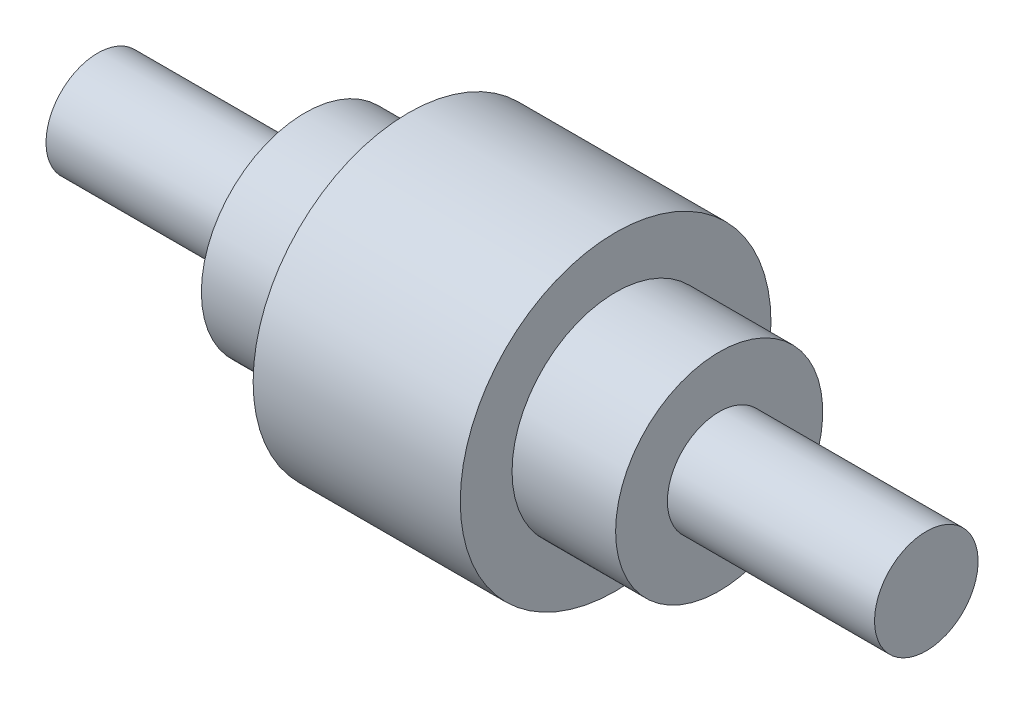
ISO-10303-21;
HEADER;
FILE_DESCRIPTION(('STEP AP214'),'2;1');
FILE_NAME('part.step','',(''),(''),'','','');
FILE_SCHEMA(('AUTOMOTIVE_DESIGN { 1 0 10303 214 1 1 1 1 }'));
ENDSEC;
DATA;
#1=APPLICATION_CONTEXT('core data for automotive mechanical design processes');
#2=APPLICATION_PROTOCOL_DEFINITION('international standard','automotive_design',2000,#1);
#3=PRODUCT_CONTEXT('',#1,'mechanical');
#4=PRODUCT('Part','Part','',(#3));
#5=PRODUCT_RELATED_PRODUCT_CATEGORY('part','',(#4));
#6=PRODUCT_DEFINITION_FORMATION('','',#4);
#7=PRODUCT_DEFINITION_CONTEXT('part definition',#1,'design');
#8=PRODUCT_DEFINITION('design','',#6,#7);
#9=PRODUCT_DEFINITION_SHAPE('','',#8);
#10=(LENGTH_UNIT() NAMED_UNIT(*) SI_UNIT(.MILLI.,.METRE.));
#11=(NAMED_UNIT(*) PLANE_ANGLE_UNIT() SI_UNIT($,.RADIAN.));
#12=(NAMED_UNIT(*) SI_UNIT($,.STERADIAN.) SOLID_ANGLE_UNIT());
#13=UNCERTAINTY_MEASURE_WITH_UNIT(LENGTH_MEASURE(1.E-05),#10,'distance_accuracy_value','');
#14=(GEOMETRIC_REPRESENTATION_CONTEXT(3) GLOBAL_UNCERTAINTY_ASSIGNED_CONTEXT((#13)) GLOBAL_UNIT_ASSIGNED_CONTEXT((#10,
#11,#12)) REPRESENTATION_CONTEXT('',''));
#15=CARTESIAN_POINT('',(0.,0.,0.));
#16=DIRECTION('',(0.,0.,1.));
#17=DIRECTION('',(1.,0.,0.));
#18=AXIS2_PLACEMENT_3D('',#15,#16,#17);
#19=CARTESIAN_POINT('',(-160.,10.,0.));
#20=DIRECTION('',(1.,0.,0.));
#21=DIRECTION('',(0.,0.,-1.));
#22=AXIS2_PLACEMENT_3D('',#19,#20,#21);
#23=PLANE('',#22);
#24=CARTESIAN_POINT('',(-160.,0.,0.));
#25=DIRECTION('',(-1.,0.,0.));
#26=DIRECTION('',(0.,0.,1.));
#27=AXIS2_PLACEMENT_3D('',#24,#25,#26);
#28=CIRCLE('',#27,20.);
#29=CARTESIAN_POINT('',(-160.,0.,20.));
#30=VERTEX_POINT('',#29);
#31=EDGE_CURVE('E96',#30,#30,#28,.T.);
#32=ORIENTED_EDGE('',*,*,#31,.T.);
#33=EDGE_LOOP('',(#32));
#34=FACE_BOUND('',#33,.T.);
#35=ADVANCED_FACE('F31',(#34),#23,.F.);
#36=CARTESIAN_POINT('',(160.,10.,0.));
#37=DIRECTION('',(-1.,0.,0.));
#38=DIRECTION('',(0.,0.,1.));
#39=AXIS2_PLACEMENT_3D('',#36,#37,#38);
#40=PLANE('',#39);
#41=CARTESIAN_POINT('',(160.,0.,0.));
#42=DIRECTION('',(-1.,0.,0.));
#43=DIRECTION('',(0.,0.,1.));
#44=AXIS2_PLACEMENT_3D('',#41,#42,#43);
#45=CIRCLE('',#44,20.);
#46=CARTESIAN_POINT('',(160.,0.,20.));
#47=VERTEX_POINT('',#46);
#48=EDGE_CURVE('E69',#47,#47,#45,.T.);
#49=ORIENTED_EDGE('',*,*,#48,.F.);
#50=EDGE_LOOP('',(#49));
#51=FACE_BOUND('',#50,.T.);
#52=ADVANCED_FACE('F152',(#51),#40,.F.);
#53=CARTESIAN_POINT('',(-150.,0.,0.));
#54=DIRECTION('',(-1.,0.,0.));
#55=DIRECTION('',(0.,0.,1.));
#56=AXIS2_PLACEMENT_3D('',#53,#54,#55);
#57=CYLINDRICAL_SURFACE('',#56,20.);
#58=CARTESIAN_POINT('',(80.,0.,0.));
#59=DIRECTION('',(-1.,0.,0.));
#60=DIRECTION('',(0.,0.,1.));
#61=AXIS2_PLACEMENT_3D('',#58,#59,#60);
#62=CIRCLE('',#61,20.);
#63=CARTESIAN_POINT('',(80.,0.,20.));
#64=VERTEX_POINT('',#63);
#65=EDGE_CURVE('E72',#64,#64,#62,.T.);
#66=ORIENTED_EDGE('',*,*,#65,.F.);
#67=EDGE_LOOP('',(#66));
#68=FACE_BOUND('',#67,.T.);
#69=ORIENTED_EDGE('',*,*,#48,.T.);
#70=EDGE_LOOP('',(#69));
#71=FACE_BOUND('',#70,.T.);
#72=ADVANCED_FACE('F146',(#68,#71),#57,.T.);
#73=CARTESIAN_POINT('',(80.,30.,0.));
#74=DIRECTION('',(-1.,0.,0.));
#75=DIRECTION('',(0.,0.,1.));
#76=AXIS2_PLACEMENT_3D('',#73,#74,#75);
#77=PLANE('',#76);
#78=CARTESIAN_POINT('',(80.,0.,0.));
#79=DIRECTION('',(-1.,0.,0.));
#80=DIRECTION('',(0.,0.,1.));
#81=AXIS2_PLACEMENT_3D('',#78,#79,#80);
#82=CIRCLE('',#81,40.);
#83=CARTESIAN_POINT('',(80.,0.,40.));
#84=VERTEX_POINT('',#83);
#85=EDGE_CURVE('E75',#84,#84,#82,.T.);
#86=ORIENTED_EDGE('',*,*,#85,.F.);
#87=EDGE_LOOP('',(#86));
#88=FACE_BOUND('',#87,.T.);
#89=ORIENTED_EDGE('',*,*,#65,.T.);
#90=EDGE_LOOP('',(#89));
#91=FACE_BOUND('',#90,.T.);
#92=ADVANCED_FACE('F140',(#88,#91),#77,.F.);
#93=CARTESIAN_POINT('',(-150.,0.,0.));
#94=DIRECTION('',(-1.,0.,0.));
#95=DIRECTION('',(0.,0.,1.));
#96=AXIS2_PLACEMENT_3D('',#93,#94,#95);
#97=CYLINDRICAL_SURFACE('',#96,40.);
#98=CARTESIAN_POINT('',(40.,0.,0.));
#99=DIRECTION('',(-1.,0.,0.));
#100=DIRECTION('',(0.,0.,1.));
#101=AXIS2_PLACEMENT_3D('',#98,#99,#100);
#102=CIRCLE('',#101,40.);
#103=CARTESIAN_POINT('',(40.,0.,40.));
#104=VERTEX_POINT('',#103);
#105=EDGE_CURVE('E78',#104,#104,#102,.T.);
#106=ORIENTED_EDGE('',*,*,#105,.F.);
#107=EDGE_LOOP('',(#106));
#108=FACE_BOUND('',#107,.T.);
#109=ORIENTED_EDGE('',*,*,#85,.T.);
#110=EDGE_LOOP('',(#109));
#111=FACE_BOUND('',#110,.T.);
#112=ADVANCED_FACE('F134',(#108,#111),#97,.T.);
#113=CARTESIAN_POINT('',(40.,50.,0.));
#114=DIRECTION('',(-1.,0.,0.));
#115=DIRECTION('',(0.,0.,1.));
#116=AXIS2_PLACEMENT_3D('',#113,#114,#115);
#117=PLANE('',#116);
#118=CARTESIAN_POINT('',(40.,0.,0.));
#119=DIRECTION('',(-1.,0.,0.));
#120=DIRECTION('',(0.,0.,1.));
#121=AXIS2_PLACEMENT_3D('',#118,#119,#120);
#122=CIRCLE('',#121,60.);
#123=CARTESIAN_POINT('',(40.,0.,60.));
#124=VERTEX_POINT('',#123);
#125=EDGE_CURVE('E81',#124,#124,#122,.T.);
#126=ORIENTED_EDGE('',*,*,#125,.F.);
#127=EDGE_LOOP('',(#126));
#128=FACE_BOUND('',#127,.T.);
#129=ORIENTED_EDGE('',*,*,#105,.T.);
#130=EDGE_LOOP('',(#129));
#131=FACE_BOUND('',#130,.T.);
#132=ADVANCED_FACE('F128',(#128,#131),#117,.F.);
#133=CARTESIAN_POINT('',(-150.,0.,0.));
#134=DIRECTION('',(-1.,0.,0.));
#135=DIRECTION('',(0.,0.,1.));
#136=AXIS2_PLACEMENT_3D('',#133,#134,#135);
#137=CYLINDRICAL_SURFACE('',#136,60.);
#138=CARTESIAN_POINT('',(-40.,0.,0.));
#139=DIRECTION('',(-1.,0.,0.));
#140=DIRECTION('',(0.,0.,1.));
#141=AXIS2_PLACEMENT_3D('',#138,#139,#140);
#142=CIRCLE('',#141,60.);
#143=CARTESIAN_POINT('',(-40.,0.,60.));
#144=VERTEX_POINT('',#143);
#145=EDGE_CURVE('E84',#144,#144,#142,.T.);
#146=ORIENTED_EDGE('',*,*,#145,.F.);
#147=EDGE_LOOP('',(#146));
#148=FACE_BOUND('',#147,.T.);
#149=ORIENTED_EDGE('',*,*,#125,.T.);
#150=EDGE_LOOP('',(#149));
#151=FACE_BOUND('',#150,.T.);
#152=ADVANCED_FACE('F122',(#148,#151),#137,.T.);
#153=CARTESIAN_POINT('',(-40.,50.,0.));
#154=DIRECTION('',(1.,0.,0.));
#155=DIRECTION('',(0.,0.,-1.));
#156=AXIS2_PLACEMENT_3D('',#153,#154,#155);
#157=PLANE('',#156);
#158=CARTESIAN_POINT('',(-40.,0.,0.));
#159=DIRECTION('',(-1.,0.,0.));
#160=DIRECTION('',(0.,0.,1.));
#161=AXIS2_PLACEMENT_3D('',#158,#159,#160);
#162=CIRCLE('',#161,40.);
#163=CARTESIAN_POINT('',(-40.,0.,40.));
#164=VERTEX_POINT('',#163);
#165=EDGE_CURVE('E87',#164,#164,#162,.T.);
#166=ORIENTED_EDGE('',*,*,#165,.F.);
#167=EDGE_LOOP('',(#166));
#168=FACE_BOUND('',#167,.T.);
#169=ORIENTED_EDGE('',*,*,#145,.T.);
#170=EDGE_LOOP('',(#169));
#171=FACE_BOUND('',#170,.T.);
#172=ADVANCED_FACE('F116',(#168,#171),#157,.F.);
#173=CARTESIAN_POINT('',(-150.,0.,0.));
#174=DIRECTION('',(-1.,0.,0.));
#175=DIRECTION('',(0.,0.,1.));
#176=AXIS2_PLACEMENT_3D('',#173,#174,#175);
#177=CYLINDRICAL_SURFACE('',#176,40.);
#178=CARTESIAN_POINT('',(-80.,0.,0.));
#179=DIRECTION('',(-1.,0.,0.));
#180=DIRECTION('',(0.,0.,1.));
#181=AXIS2_PLACEMENT_3D('',#178,#179,#180);
#182=CIRCLE('',#181,40.);
#183=CARTESIAN_POINT('',(-80.,0.,40.));
#184=VERTEX_POINT('',#183);
#185=EDGE_CURVE('E90',#184,#184,#182,.T.);
#186=ORIENTED_EDGE('',*,*,#185,.F.);
#187=EDGE_LOOP('',(#186));
#188=FACE_BOUND('',#187,.T.);
#189=ORIENTED_EDGE('',*,*,#165,.T.);
#190=EDGE_LOOP('',(#189));
#191=FACE_BOUND('',#190,.T.);
#192=ADVANCED_FACE('F110',(#188,#191),#177,.T.);
#193=CARTESIAN_POINT('',(-80.,30.,0.));
#194=DIRECTION('',(1.,0.,0.));
#195=DIRECTION('',(0.,0.,-1.));
#196=AXIS2_PLACEMENT_3D('',#193,#194,#195);
#197=PLANE('',#196);
#198=CARTESIAN_POINT('',(-80.,0.,0.));
#199=DIRECTION('',(-1.,0.,0.));
#200=DIRECTION('',(0.,0.,1.));
#201=AXIS2_PLACEMENT_3D('',#198,#199,#200);
#202=CIRCLE('',#201,20.);
#203=CARTESIAN_POINT('',(-80.,0.,20.));
#204=VERTEX_POINT('',#203);
#205=EDGE_CURVE('E93',#204,#204,#202,.T.);
#206=ORIENTED_EDGE('',*,*,#205,.F.);
#207=EDGE_LOOP('',(#206));
#208=FACE_BOUND('',#207,.T.);
#209=ORIENTED_EDGE('',*,*,#185,.T.);
#210=EDGE_LOOP('',(#209));
#211=FACE_BOUND('',#210,.T.);
#212=ADVANCED_FACE('F104',(#208,#211),#197,.F.);
#213=CARTESIAN_POINT('',(-150.,0.,0.));
#214=DIRECTION('',(-1.,0.,0.));
#215=DIRECTION('',(0.,0.,1.));
#216=AXIS2_PLACEMENT_3D('',#213,#214,#215);
#217=CYLINDRICAL_SURFACE('',#216,20.);
#218=ORIENTED_EDGE('',*,*,#31,.F.);
#219=EDGE_LOOP('',(#218));
#220=FACE_BOUND('',#219,.T.);
#221=ORIENTED_EDGE('',*,*,#205,.T.);
#222=EDGE_LOOP('',(#221));
#223=FACE_BOUND('',#222,.T.);
#224=ADVANCED_FACE('F101',(#220,#223),#217,.T.);
#225=CLOSED_SHELL('',(#35,#52,#72,#92,#112,#132,#152,#172,#192,#212,#224));
#226=CARTESIAN_POINT('',(-150.,10.,0.));
#227=DIRECTION('',(1.,0.,0.));
#228=DIRECTION('',(0.,0.,-1.));
#229=AXIS2_PLACEMENT_3D('',#226,#227,#228);
#230=PLANE('',#229);
#231=CARTESIAN_POINT('',(-150.,0.,0.));
#232=DIRECTION('',(-1.,0.,0.));
#233=DIRECTION('',(0.,0.,1.));
#234=AXIS2_PLACEMENT_3D('',#231,#232,#233);
#235=CIRCLE('',#234,10.);
#236=CARTESIAN_POINT('',(-150.,0.,10.));
#237=VERTEX_POINT('',#236);
#238=EDGE_CURVE('E10',#237,#237,#235,.T.);
#239=ORIENTED_EDGE('',*,*,#238,.F.);
#240=EDGE_LOOP('',(#239));
#241=FACE_BOUND('',#240,.T.);
#242=ADVANCED_FACE('F200',(#241),#230,.T.);
#243=CARTESIAN_POINT('',(-150.,0.,0.));
#244=DIRECTION('',(-1.,0.,0.));
#245=DIRECTION('',(0.,0.,1.));
#246=AXIS2_PLACEMENT_3D('',#243,#244,#245);
#247=CYLINDRICAL_SURFACE('',#246,10.);
#248=ORIENTED_EDGE('',*,*,#238,.T.);
#249=EDGE_LOOP('',(#248));
#250=FACE_BOUND('',#249,.T.);
#251=CARTESIAN_POINT('',(-70.,0.,0.));
#252=DIRECTION('',(-1.,0.,0.));
#253=DIRECTION('',(0.,0.,1.));
#254=AXIS2_PLACEMENT_3D('',#251,#252,#253);
#255=CIRCLE('',#254,10.);
#256=CARTESIAN_POINT('',(-70.,0.,10.));
#257=VERTEX_POINT('',#256);
#258=EDGE_CURVE('E38',#257,#257,#255,.T.);
#259=ORIENTED_EDGE('',*,*,#258,.F.);
#260=EDGE_LOOP('',(#259));
#261=FACE_BOUND('',#260,.T.);
#262=ADVANCED_FACE('F198',(#250,#261),#247,.F.);
#263=CARTESIAN_POINT('',(-70.,30.,0.));
#264=DIRECTION('',(1.,0.,0.));
#265=DIRECTION('',(0.,0.,-1.));
#266=AXIS2_PLACEMENT_3D('',#263,#264,#265);
#267=PLANE('',#266);
#268=ORIENTED_EDGE('',*,*,#258,.T.);
#269=EDGE_LOOP('',(#268));
#270=FACE_BOUND('',#269,.T.);
#271=CARTESIAN_POINT('',(-70.,0.,0.));
#272=DIRECTION('',(-1.,0.,0.));
#273=DIRECTION('',(0.,0.,1.));
#274=AXIS2_PLACEMENT_3D('',#271,#272,#273);
#275=CIRCLE('',#274,30.);
#276=CARTESIAN_POINT('',(-70.,0.,30.));
#277=VERTEX_POINT('',#276);
#278=EDGE_CURVE('E42',#277,#277,#275,.T.);
#279=ORIENTED_EDGE('',*,*,#278,.F.);
#280=EDGE_LOOP('',(#279));
#281=FACE_BOUND('',#280,.T.);
#282=ADVANCED_FACE('F194',(#270,#281),#267,.T.);
#283=CARTESIAN_POINT('',(-150.,0.,0.));
#284=DIRECTION('',(-1.,0.,0.));
#285=DIRECTION('',(0.,0.,1.));
#286=AXIS2_PLACEMENT_3D('',#283,#284,#285);
#287=CYLINDRICAL_SURFACE('',#286,30.);
#288=ORIENTED_EDGE('',*,*,#278,.T.);
#289=EDGE_LOOP('',(#288));
#290=FACE_BOUND('',#289,.T.);
#291=CARTESIAN_POINT('',(-30.,0.,0.));
#292=DIRECTION('',(-1.,0.,0.));
#293=DIRECTION('',(0.,0.,1.));
#294=AXIS2_PLACEMENT_3D('',#291,#292,#293);
#295=CIRCLE('',#294,30.);
#296=CARTESIAN_POINT('',(-30.,0.,30.));
#297=VERTEX_POINT('',#296);
#298=EDGE_CURVE('E46',#297,#297,#295,.T.);
#299=ORIENTED_EDGE('',*,*,#298,.F.);
#300=EDGE_LOOP('',(#299));
#301=FACE_BOUND('',#300,.T.);
#302=ADVANCED_FACE('F190',(#290,#301),#287,.F.);
#303=CARTESIAN_POINT('',(-30.,50.,0.));
#304=DIRECTION('',(1.,0.,0.));
#305=DIRECTION('',(0.,0.,-1.));
#306=AXIS2_PLACEMENT_3D('',#303,#304,#305);
#307=PLANE('',#306);
#308=ORIENTED_EDGE('',*,*,#298,.T.);
#309=EDGE_LOOP('',(#308));
#310=FACE_BOUND('',#309,.T.);
#311=CARTESIAN_POINT('',(-30.,0.,0.));
#312=DIRECTION('',(-1.,0.,0.));
#313=DIRECTION('',(0.,0.,1.));
#314=AXIS2_PLACEMENT_3D('',#311,#312,#313);
#315=CIRCLE('',#314,50.);
#316=CARTESIAN_POINT('',(-30.,0.,50.));
#317=VERTEX_POINT('',#316);
#318=EDGE_CURVE('E51',#317,#317,#315,.T.);
#319=ORIENTED_EDGE('',*,*,#318,.F.);
#320=EDGE_LOOP('',(#319));
#321=FACE_BOUND('',#320,.T.);
#322=ADVANCED_FACE('F186',(#310,#321),#307,.T.);
#323=CARTESIAN_POINT('',(-150.,0.,0.));
#324=DIRECTION('',(-1.,0.,0.));
#325=DIRECTION('',(0.,0.,1.));
#326=AXIS2_PLACEMENT_3D('',#323,#324,#325);
#327=CYLINDRICAL_SURFACE('',#326,50.);
#328=ORIENTED_EDGE('',*,*,#318,.T.);
#329=EDGE_LOOP('',(#328));
#330=FACE_BOUND('',#329,.T.);
#331=CARTESIAN_POINT('',(30.,0.,0.));
#332=DIRECTION('',(-1.,0.,0.));
#333=DIRECTION('',(0.,0.,1.));
#334=AXIS2_PLACEMENT_3D('',#331,#332,#333);
#335=CIRCLE('',#334,50.);
#336=CARTESIAN_POINT('',(30.,0.,50.));
#337=VERTEX_POINT('',#336);
#338=EDGE_CURVE('E54',#337,#337,#335,.T.);
#339=ORIENTED_EDGE('',*,*,#338,.F.);
#340=EDGE_LOOP('',(#339));
#341=FACE_BOUND('',#340,.T.);
#342=ADVANCED_FACE('F182',(#330,#341),#327,.F.);
#343=CARTESIAN_POINT('',(30.,50.,0.));
#344=DIRECTION('',(-1.,0.,0.));
#345=DIRECTION('',(0.,0.,1.));
#346=AXIS2_PLACEMENT_3D('',#343,#344,#345);
#347=PLANE('',#346);
#348=ORIENTED_EDGE('',*,*,#338,.T.);
#349=EDGE_LOOP('',(#348));
#350=FACE_BOUND('',#349,.T.);
#351=CARTESIAN_POINT('',(30.,0.,0.));
#352=DIRECTION('',(-1.,0.,0.));
#353=DIRECTION('',(0.,0.,1.));
#354=AXIS2_PLACEMENT_3D('',#351,#352,#353);
#355=CIRCLE('',#354,30.);
#356=CARTESIAN_POINT('',(30.,0.,30.));
#357=VERTEX_POINT('',#356);
#358=EDGE_CURVE('E57',#357,#357,#355,.T.);
#359=ORIENTED_EDGE('',*,*,#358,.F.);
#360=EDGE_LOOP('',(#359));
#361=FACE_BOUND('',#360,.T.);
#362=ADVANCED_FACE('F178',(#350,#361),#347,.T.);
#363=CARTESIAN_POINT('',(-150.,0.,0.));
#364=DIRECTION('',(-1.,0.,0.));
#365=DIRECTION('',(0.,0.,1.));
#366=AXIS2_PLACEMENT_3D('',#363,#364,#365);
#367=CYLINDRICAL_SURFACE('',#366,30.);
#368=ORIENTED_EDGE('',*,*,#358,.T.);
#369=EDGE_LOOP('',(#368));
#370=FACE_BOUND('',#369,.T.);
#371=CARTESIAN_POINT('',(70.,0.,0.));
#372=DIRECTION('',(-1.,0.,0.));
#373=DIRECTION('',(0.,0.,1.));
#374=AXIS2_PLACEMENT_3D('',#371,#372,#373);
#375=CIRCLE('',#374,30.);
#376=CARTESIAN_POINT('',(70.,0.,30.));
#377=VERTEX_POINT('',#376);
#378=EDGE_CURVE('E60',#377,#377,#375,.T.);
#379=ORIENTED_EDGE('',*,*,#378,.F.);
#380=EDGE_LOOP('',(#379));
#381=FACE_BOUND('',#380,.T.);
#382=ADVANCED_FACE('F174',(#370,#381),#367,.F.);
#383=CARTESIAN_POINT('',(70.,30.,0.));
#384=DIRECTION('',(-1.,0.,0.));
#385=DIRECTION('',(0.,0.,1.));
#386=AXIS2_PLACEMENT_3D('',#383,#384,#385);
#387=PLANE('',#386);
#388=ORIENTED_EDGE('',*,*,#378,.T.);
#389=EDGE_LOOP('',(#388));
#390=FACE_BOUND('',#389,.T.);
#391=CARTESIAN_POINT('',(70.,0.,0.));
#392=DIRECTION('',(-1.,0.,0.));
#393=DIRECTION('',(0.,0.,1.));
#394=AXIS2_PLACEMENT_3D('',#391,#392,#393);
#395=CIRCLE('',#394,10.);
#396=CARTESIAN_POINT('',(70.,0.,10.));
#397=VERTEX_POINT('',#396);
#398=EDGE_CURVE('E63',#397,#397,#395,.T.);
#399=ORIENTED_EDGE('',*,*,#398,.F.);
#400=EDGE_LOOP('',(#399));
#401=FACE_BOUND('',#400,.T.);
#402=ADVANCED_FACE('F170',(#390,#401),#387,.T.);
#403=CARTESIAN_POINT('',(-150.,0.,0.));
#404=DIRECTION('',(-1.,0.,0.));
#405=DIRECTION('',(0.,0.,1.));
#406=AXIS2_PLACEMENT_3D('',#403,#404,#405);
#407=CYLINDRICAL_SURFACE('',#406,10.);
#408=ORIENTED_EDGE('',*,*,#398,.T.);
#409=EDGE_LOOP('',(#408));
#410=FACE_BOUND('',#409,.T.);
#411=CARTESIAN_POINT('',(150.,0.,0.));
#412=DIRECTION('',(-1.,0.,0.));
#413=DIRECTION('',(0.,0.,1.));
#414=AXIS2_PLACEMENT_3D('',#411,#412,#413);
#415=CIRCLE('',#414,10.);
#416=CARTESIAN_POINT('',(150.,0.,10.));
#417=VERTEX_POINT('',#416);
#418=EDGE_CURVE('E66',#417,#417,#415,.T.);
#419=ORIENTED_EDGE('',*,*,#418,.F.);
#420=EDGE_LOOP('',(#419));
#421=FACE_BOUND('',#420,.T.);
#422=ADVANCED_FACE('F165',(#410,#421),#407,.F.);
#423=CARTESIAN_POINT('',(150.,10.,0.));
#424=DIRECTION('',(-1.,0.,0.));
#425=DIRECTION('',(0.,0.,1.));
#426=AXIS2_PLACEMENT_3D('',#423,#424,#425);
#427=PLANE('',#426);
#428=ORIENTED_EDGE('',*,*,#418,.T.);
#429=EDGE_LOOP('',(#428));
#430=FACE_BOUND('',#429,.T.);
#431=ADVANCED_FACE('F162',(#430),#427,.T.);
#432=CLOSED_SHELL('',(#242,#262,#282,#302,#322,#342,#362,#382,#402,#422,#431));
#433=ORIENTED_CLOSED_SHELL('',*,#432,.T.);
#434=BREP_WITH_VOIDS('B2',#225,(#433));
#435=ADVANCED_BREP_SHAPE_REPRESENTATION('',(#18,#434),#14);
#436=SHAPE_DEFINITION_REPRESENTATION(#9,#435);
ENDSEC;
END-ISO-10303-21;
